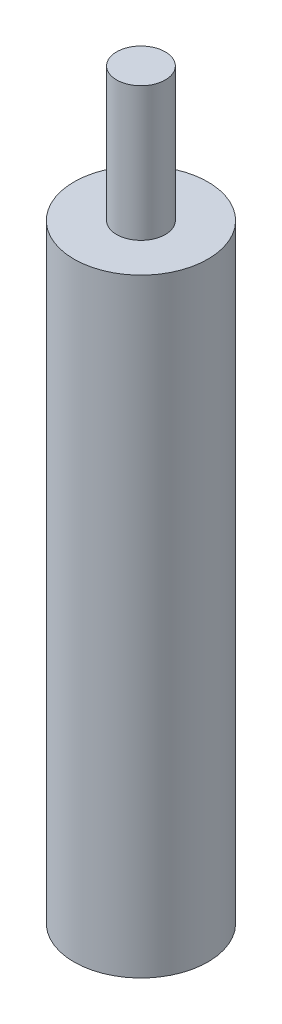
ISO-10303-21;
HEADER;
FILE_DESCRIPTION(('STEP AP214'),'2;1');
FILE_NAME('part.step','',(''),(''),'','','');
FILE_SCHEMA(('AUTOMOTIVE_DESIGN { 1 0 10303 214 1 1 1 1 }'));
ENDSEC;
DATA;
#1=APPLICATION_CONTEXT('core data for automotive mechanical design processes');
#2=APPLICATION_PROTOCOL_DEFINITION('international standard','automotive_design',2000,#1);
#3=PRODUCT_CONTEXT('',#1,'mechanical');
#4=PRODUCT('Part','Part','',(#3));
#5=PRODUCT_RELATED_PRODUCT_CATEGORY('part','',(#4));
#6=PRODUCT_DEFINITION_FORMATION('','',#4);
#7=PRODUCT_DEFINITION_CONTEXT('part definition',#1,'design');
#8=PRODUCT_DEFINITION('design','',#6,#7);
#9=PRODUCT_DEFINITION_SHAPE('','',#8);
#10=(LENGTH_UNIT() NAMED_UNIT(*) SI_UNIT(.MILLI.,.METRE.));
#11=(NAMED_UNIT(*) PLANE_ANGLE_UNIT() SI_UNIT($,.RADIAN.));
#12=(NAMED_UNIT(*) SI_UNIT($,.STERADIAN.) SOLID_ANGLE_UNIT());
#13=UNCERTAINTY_MEASURE_WITH_UNIT(LENGTH_MEASURE(1.E-05),#10,'distance_accuracy_value','');
#14=(GEOMETRIC_REPRESENTATION_CONTEXT(3) GLOBAL_UNCERTAINTY_ASSIGNED_CONTEXT((#13)) GLOBAL_UNIT_ASSIGNED_CONTEXT((#10,
#11,#12)) REPRESENTATION_CONTEXT('',''));
#15=CARTESIAN_POINT('',(0.,0.,0.));
#16=DIRECTION('',(0.,0.,1.));
#17=DIRECTION('',(1.,0.,0.));
#18=AXIS2_PLACEMENT_3D('',#15,#16,#17);
#19=CARTESIAN_POINT('',(0.,50.,0.));
#20=DIRECTION('',(0.,1.,0.));
#21=DIRECTION('',(0.,0.,1.));
#22=AXIS2_PLACEMENT_3D('',#19,#20,#21);
#23=PLANE('',#22);
#24=CARTESIAN_POINT('',(0.,50.,0.));
#25=DIRECTION('',(0.,1.,0.));
#26=DIRECTION('',(0.,0.,1.));
#27=AXIS2_PLACEMENT_3D('',#24,#25,#26);
#28=CIRCLE('',#27,5.5);
#29=CARTESIAN_POINT('',(0.,50.,5.5));
#30=VERTEX_POINT('',#29);
#31=EDGE_CURVE('E10',#30,#30,#28,.T.);
#32=ORIENTED_EDGE('',*,*,#31,.T.);
#33=EDGE_LOOP('',(#32));
#34=FACE_BOUND('',#33,.T.);
#35=CARTESIAN_POINT('',(0.,50.,0.));
#36=DIRECTION('',(0.,1.,0.));
#37=DIRECTION('',(0.,0.,1.));
#38=AXIS2_PLACEMENT_3D('',#35,#36,#37);
#39=CIRCLE('',#38,2.);
#40=CARTESIAN_POINT('',(0.,50.,2.));
#41=VERTEX_POINT('',#40);
#42=EDGE_CURVE('E43',#41,#41,#39,.T.);
#43=ORIENTED_EDGE('',*,*,#42,.F.);
#44=EDGE_LOOP('',(#43));
#45=FACE_BOUND('',#44,.T.);
#46=ADVANCED_FACE('F30',(#34,#45),#23,.T.);
#47=CARTESIAN_POINT('',(0.,50.,0.));
#48=DIRECTION('',(0.,-1.,0.));
#49=DIRECTION('',(0.,0.,-1.));
#50=AXIS2_PLACEMENT_3D('',#47,#48,#49);
#51=CYLINDRICAL_SURFACE('',#50,5.5);
#52=ORIENTED_EDGE('',*,*,#31,.F.);
#53=EDGE_LOOP('',(#52));
#54=FACE_BOUND('',#53,.T.);
#55=CARTESIAN_POINT('',(0.,0.,0.));
#56=DIRECTION('',(0.,1.,0.));
#57=DIRECTION('',(0.,0.,1.));
#58=AXIS2_PLACEMENT_3D('',#55,#56,#57);
#59=CIRCLE('',#58,5.5);
#60=CARTESIAN_POINT('',(0.,0.,5.5));
#61=VERTEX_POINT('',#60);
#62=EDGE_CURVE('E34',#61,#61,#59,.T.);
#63=ORIENTED_EDGE('',*,*,#62,.T.);
#64=EDGE_LOOP('',(#63));
#65=FACE_BOUND('',#64,.T.);
#66=ADVANCED_FACE('F32',(#54,#65),#51,.T.);
#67=CARTESIAN_POINT('',(0.,0.,0.));
#68=DIRECTION('',(0.,1.,0.));
#69=DIRECTION('',(0.,0.,1.));
#70=AXIS2_PLACEMENT_3D('',#67,#68,#69);
#71=PLANE('',#70);
#72=CARTESIAN_POINT('',(0.,0.,0.));
#73=DIRECTION('',(0.,-1.,0.));
#74=DIRECTION('',(0.,0.,-1.));
#75=AXIS2_PLACEMENT_3D('',#72,#73,#74);
#76=CIRCLE('',#75,2.);
#77=CARTESIAN_POINT('',(0.,0.,-2.));
#78=VERTEX_POINT('',#77);
#79=EDGE_CURVE('E49',#78,#78,#76,.T.);
#80=ORIENTED_EDGE('',*,*,#79,.F.);
#81=EDGE_LOOP('',(#80));
#82=FACE_BOUND('',#81,.T.);
#83=ORIENTED_EDGE('',*,*,#62,.F.);
#84=EDGE_LOOP('',(#83));
#85=FACE_BOUND('',#84,.T.);
#86=ADVANCED_FACE('F64',(#82,#85),#71,.F.);
#87=CARTESIAN_POINT('',(0.,61.,0.));
#88=DIRECTION('',(0.,-1.,0.));
#89=DIRECTION('',(0.,0.,-1.));
#90=AXIS2_PLACEMENT_3D('',#87,#88,#89);
#91=CYLINDRICAL_SURFACE('',#90,2.);
#92=CARTESIAN_POINT('',(0.,61.,0.));
#93=DIRECTION('',(0.,1.,0.));
#94=DIRECTION('',(0.,0.,1.));
#95=AXIS2_PLACEMENT_3D('',#92,#93,#94);
#96=CIRCLE('',#95,2.);
#97=CARTESIAN_POINT('',(0.,61.,2.));
#98=VERTEX_POINT('',#97);
#99=EDGE_CURVE('E41',#98,#98,#96,.T.);
#100=ORIENTED_EDGE('',*,*,#99,.F.);
#101=EDGE_LOOP('',(#100));
#102=FACE_BOUND('',#101,.T.);
#103=ORIENTED_EDGE('',*,*,#42,.T.);
#104=EDGE_LOOP('',(#103));
#105=FACE_BOUND('',#104,.T.);
#106=ADVANCED_FACE('F67',(#102,#105),#91,.T.);
#107=CARTESIAN_POINT('',(0.,61.,0.));
#108=DIRECTION('',(0.,1.,0.));
#109=DIRECTION('',(0.,0.,1.));
#110=AXIS2_PLACEMENT_3D('',#107,#108,#109);
#111=PLANE('',#110);
#112=ORIENTED_EDGE('',*,*,#99,.T.);
#113=EDGE_LOOP('',(#112));
#114=FACE_BOUND('',#113,.T.);
#115=ADVANCED_FACE('F60',(#114),#111,.T.);
#116=CARTESIAN_POINT('',(0.,11.,0.));
#117=DIRECTION('',(0.,-1.,0.));
#118=DIRECTION('',(0.,0.,-1.));
#119=AXIS2_PLACEMENT_3D('',#116,#117,#118);
#120=CYLINDRICAL_SURFACE('',#119,2.);
#121=CARTESIAN_POINT('',(0.,11.,0.));
#122=DIRECTION('',(0.,-1.,0.));
#123=DIRECTION('',(0.,0.,-1.));
#124=AXIS2_PLACEMENT_3D('',#121,#122,#123);
#125=CIRCLE('',#124,2.);
#126=CARTESIAN_POINT('',(0.,11.,-2.));
#127=VERTEX_POINT('',#126);
#128=EDGE_CURVE('E46',#127,#127,#125,.T.);
#129=ORIENTED_EDGE('',*,*,#128,.F.);
#130=EDGE_LOOP('',(#129));
#131=FACE_BOUND('',#130,.T.);
#132=ORIENTED_EDGE('',*,*,#79,.T.);
#133=EDGE_LOOP('',(#132));
#134=FACE_BOUND('',#133,.T.);
#135=ADVANCED_FACE('F57',(#131,#134),#120,.F.);
#136=CARTESIAN_POINT('',(0.,11.,0.));
#137=DIRECTION('',(0.,-1.,0.));
#138=DIRECTION('',(0.,0.,-1.));
#139=AXIS2_PLACEMENT_3D('',#136,#137,#138);
#140=PLANE('',#139);
#141=ORIENTED_EDGE('',*,*,#128,.T.);
#142=EDGE_LOOP('',(#141));
#143=FACE_BOUND('',#142,.T.);
#144=ADVANCED_FACE('F55',(#143),#140,.T.);
#145=CLOSED_SHELL('',(#46,#66,#86,#106,#115,#135,#144));
#146=MANIFOLD_SOLID_BREP('B2',#145);
#147=ADVANCED_BREP_SHAPE_REPRESENTATION('',(#18,#146),#14);
#148=SHAPE_DEFINITION_REPRESENTATION(#9,#147);
ENDSEC;
END-ISO-10303-21;
